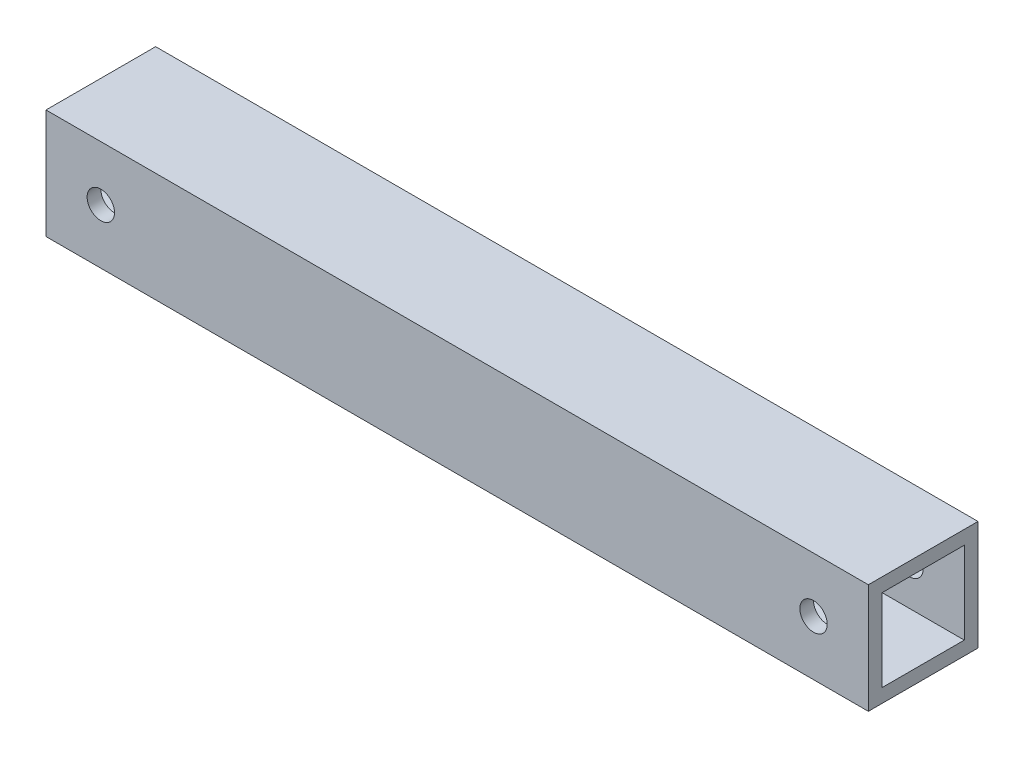
ISO-10303-21;
HEADER;
FILE_DESCRIPTION(('STEP AP214'),'2;1');
FILE_NAME('part.step','',(''),(''),'','','');
FILE_SCHEMA(('AUTOMOTIVE_DESIGN { 1 0 10303 214 1 1 1 1 }'));
ENDSEC;
DATA;
#1=APPLICATION_CONTEXT('core data for automotive mechanical design processes');
#2=APPLICATION_PROTOCOL_DEFINITION('international standard','automotive_design',2000,#1);
#3=PRODUCT_CONTEXT('',#1,'mechanical');
#4=PRODUCT('Part','Part','',(#3));
#5=PRODUCT_RELATED_PRODUCT_CATEGORY('part','',(#4));
#6=PRODUCT_DEFINITION_FORMATION('','',#4);
#7=PRODUCT_DEFINITION_CONTEXT('part definition',#1,'design');
#8=PRODUCT_DEFINITION('design','',#6,#7);
#9=PRODUCT_DEFINITION_SHAPE('','',#8);
#10=(LENGTH_UNIT() NAMED_UNIT(*) SI_UNIT(.MILLI.,.METRE.));
#11=(NAMED_UNIT(*) PLANE_ANGLE_UNIT() SI_UNIT($,.RADIAN.));
#12=(NAMED_UNIT(*) SI_UNIT($,.STERADIAN.) SOLID_ANGLE_UNIT());
#13=UNCERTAINTY_MEASURE_WITH_UNIT(LENGTH_MEASURE(1.E-05),#10,'distance_accuracy_value','');
#14=(GEOMETRIC_REPRESENTATION_CONTEXT(3) GLOBAL_UNCERTAINTY_ASSIGNED_CONTEXT((#13)) GLOBAL_UNIT_ASSIGNED_CONTEXT((#10,
#11,#12)) REPRESENTATION_CONTEXT('',''));
#15=CARTESIAN_POINT('',(0.,0.,0.));
#16=DIRECTION('',(0.,0.,1.));
#17=DIRECTION('',(1.,0.,0.));
#18=AXIS2_PLACEMENT_3D('',#15,#16,#17);
#19=CARTESIAN_POINT('',(95.25,-12.7,25.4));
#20=DIRECTION('',(-1.,0.,0.));
#21=DIRECTION('',(0.,0.,1.));
#22=AXIS2_PLACEMENT_3D('',#19,#20,#21);
#23=PLANE('',#22);
#24=DIRECTION('',(0.,1.,0.));
#25=VECTOR('',#24,1.);
#26=CARTESIAN_POINT('',(95.25,-12.7,0.));
#27=LINE('',#26,#25);
#28=CARTESIAN_POINT('',(95.25,-12.7,0.));
#29=VERTEX_POINT('',#28);
#30=CARTESIAN_POINT('',(95.25,12.7,0.));
#31=VERTEX_POINT('',#30);
#32=EDGE_CURVE('E122',#29,#31,#27,.T.);
#33=ORIENTED_EDGE('',*,*,#32,.T.);
#34=DIRECTION('',(0.,0.,-1.));
#35=VECTOR('',#34,1.);
#36=CARTESIAN_POINT('',(95.25,12.7,25.4));
#37=LINE('',#36,#35);
#38=CARTESIAN_POINT('',(95.25,12.7,25.4));
#39=VERTEX_POINT('',#38);
#40=EDGE_CURVE('E151',#39,#31,#37,.T.);
#41=ORIENTED_EDGE('',*,*,#40,.F.);
#42=DIRECTION('',(0.,1.,0.));
#43=VECTOR('',#42,1.);
#44=CARTESIAN_POINT('',(95.25,-12.7,25.4));
#45=LINE('',#44,#43);
#46=CARTESIAN_POINT('',(95.25,-12.7,25.4));
#47=VERTEX_POINT('',#46);
#48=EDGE_CURVE('E125',#47,#39,#45,.T.);
#49=ORIENTED_EDGE('',*,*,#48,.F.);
#50=DIRECTION('',(0.,0.,-1.));
#51=VECTOR('',#50,1.);
#52=CARTESIAN_POINT('',(95.25,-12.7,25.4));
#53=LINE('',#52,#51);
#54=EDGE_CURVE('E135',#47,#29,#53,.T.);
#55=ORIENTED_EDGE('',*,*,#54,.T.);
#56=EDGE_LOOP('',(#33,#41,#49,#55));
#57=FACE_BOUND('',#56,.T.);
#58=DIRECTION('',(0.,0.,-1.));
#59=VECTOR('',#58,1.);
#60=CARTESIAN_POINT('',(95.25,9.52035864154581,0.));
#61=LINE('',#60,#59);
#62=CARTESIAN_POINT('',(95.25,9.52035864154581,22.225));
#63=VERTEX_POINT('',#62);
#64=CARTESIAN_POINT('',(95.25,9.52035864154581,3.175));
#65=VERTEX_POINT('',#64);
#66=EDGE_CURVE('E49',#63,#65,#61,.T.);
#67=ORIENTED_EDGE('',*,*,#66,.T.);
#68=DIRECTION('',(0.,1.,0.));
#69=VECTOR('',#68,1.);
#70=CARTESIAN_POINT('',(95.25,0.,3.175));
#71=LINE('',#70,#69);
#72=CARTESIAN_POINT('',(95.25,-9.52035864154582,3.175));
#73=VERTEX_POINT('',#72);
#74=EDGE_CURVE('E115',#73,#65,#71,.T.);
#75=ORIENTED_EDGE('',*,*,#74,.F.);
#76=DIRECTION('',(0.,0.,-1.));
#77=VECTOR('',#76,1.);
#78=CARTESIAN_POINT('',(95.25,-9.52035864154582,0.));
#79=LINE('',#78,#77);
#80=CARTESIAN_POINT('',(95.25,-9.52035864154582,22.225));
#81=VERTEX_POINT('',#80);
#82=EDGE_CURVE('E101',#81,#73,#79,.T.);
#83=ORIENTED_EDGE('',*,*,#82,.F.);
#84=DIRECTION('',(0.,1.,0.));
#85=VECTOR('',#84,1.);
#86=CARTESIAN_POINT('',(95.25,0.,22.225));
#87=LINE('',#86,#85);
#88=EDGE_CURVE('E110',#81,#63,#87,.T.);
#89=ORIENTED_EDGE('',*,*,#88,.T.);
#90=EDGE_LOOP('',(#67,#75,#83,#89));
#91=FACE_BOUND('',#90,.T.);
#92=ADVANCED_FACE('F33',(#57,#91),#23,.F.);
#93=CARTESIAN_POINT('',(-95.25,-12.7,25.4));
#94=DIRECTION('',(1.,0.,0.));
#95=DIRECTION('',(0.,0.,-1.));
#96=AXIS2_PLACEMENT_3D('',#93,#94,#95);
#97=PLANE('',#96);
#98=DIRECTION('',(0.,-1.,0.));
#99=VECTOR('',#98,1.);
#100=CARTESIAN_POINT('',(-95.25,-12.7,0.));
#101=LINE('',#100,#99);
#102=CARTESIAN_POINT('',(-95.25,12.7,0.));
#103=VERTEX_POINT('',#102);
#104=CARTESIAN_POINT('',(-95.25,-12.7,0.));
#105=VERTEX_POINT('',#104);
#106=EDGE_CURVE('E140',#103,#105,#101,.T.);
#107=ORIENTED_EDGE('',*,*,#106,.T.);
#108=DIRECTION('',(0.,0.,-1.));
#109=VECTOR('',#108,1.);
#110=CARTESIAN_POINT('',(-95.25,-12.7,25.4));
#111=LINE('',#110,#109);
#112=CARTESIAN_POINT('',(-95.25,-12.7,25.4));
#113=VERTEX_POINT('',#112);
#114=EDGE_CURVE('E145',#113,#105,#111,.T.);
#115=ORIENTED_EDGE('',*,*,#114,.F.);
#116=DIRECTION('',(0.,-1.,0.));
#117=VECTOR('',#116,1.);
#118=CARTESIAN_POINT('',(-95.25,-12.7,25.4));
#119=LINE('',#118,#117);
#120=CARTESIAN_POINT('',(-95.25,12.7,25.4));
#121=VERTEX_POINT('',#120);
#122=EDGE_CURVE('E131',#121,#113,#119,.T.);
#123=ORIENTED_EDGE('',*,*,#122,.F.);
#124=DIRECTION('',(0.,0.,-1.));
#125=VECTOR('',#124,1.);
#126=CARTESIAN_POINT('',(-95.25,12.7,25.4));
#127=LINE('',#126,#125);
#128=EDGE_CURVE('E148',#121,#103,#127,.T.);
#129=ORIENTED_EDGE('',*,*,#128,.T.);
#130=EDGE_LOOP('',(#107,#115,#123,#129));
#131=FACE_BOUND('',#130,.T.);
#132=DIRECTION('',(0.,0.,-1.));
#133=VECTOR('',#132,1.);
#134=CARTESIAN_POINT('',(-95.25,9.52035864154581,25.4));
#135=LINE('',#134,#133);
#136=CARTESIAN_POINT('',(-95.2499999999999,9.52035864154581,22.225));
#137=VERTEX_POINT('',#136);
#138=CARTESIAN_POINT('',(-95.2499999999999,9.52035864154581,3.175));
#139=VERTEX_POINT('',#138);
#140=EDGE_CURVE('E11',#137,#139,#135,.T.);
#141=ORIENTED_EDGE('',*,*,#140,.F.);
#142=DIRECTION('',(0.,1.,0.));
#143=VECTOR('',#142,1.);
#144=CARTESIAN_POINT('',(-95.25,-12.7,22.225));
#145=LINE('',#144,#143);
#146=CARTESIAN_POINT('',(-95.25,-9.52035864154582,22.225));
#147=VERTEX_POINT('',#146);
#148=EDGE_CURVE('E154',#147,#137,#145,.T.);
#149=ORIENTED_EDGE('',*,*,#148,.F.);
#150=DIRECTION('',(0.,0.,-1.));
#151=VECTOR('',#150,1.);
#152=CARTESIAN_POINT('',(-95.25,-9.52035864154582,25.4));
#153=LINE('',#152,#151);
#154=CARTESIAN_POINT('',(-95.2499999999999,-9.52035864154582,3.175));
#155=VERTEX_POINT('',#154);
#156=EDGE_CURVE('E104',#147,#155,#153,.T.);
#157=ORIENTED_EDGE('',*,*,#156,.T.);
#158=DIRECTION('',(0.,1.,0.));
#159=VECTOR('',#158,1.);
#160=CARTESIAN_POINT('',(-95.25,-12.7,3.175));
#161=LINE('',#160,#159);
#162=EDGE_CURVE('E41',#155,#139,#161,.T.);
#163=ORIENTED_EDGE('',*,*,#162,.T.);
#164=EDGE_LOOP('',(#141,#149,#157,#163));
#165=FACE_BOUND('',#164,.T.);
#166=ADVANCED_FACE('F208',(#131,#165),#97,.F.);
#167=CARTESIAN_POINT('',(-95.25,12.7,25.4));
#168=DIRECTION('',(0.,-1.,0.));
#169=DIRECTION('',(0.,0.,-1.));
#170=AXIS2_PLACEMENT_3D('',#167,#168,#169);
#171=PLANE('',#170);
#172=DIRECTION('',(-1.,0.,0.));
#173=VECTOR('',#172,1.);
#174=CARTESIAN_POINT('',(-95.25,12.7,0.));
#175=LINE('',#174,#173);
#176=EDGE_CURVE('E138',#31,#103,#175,.T.);
#177=ORIENTED_EDGE('',*,*,#176,.T.);
#178=ORIENTED_EDGE('',*,*,#128,.F.);
#179=DIRECTION('',(-1.,0.,0.));
#180=VECTOR('',#179,1.);
#181=CARTESIAN_POINT('',(-95.25,12.7,25.4));
#182=LINE('',#181,#180);
#183=EDGE_CURVE('E128',#39,#121,#182,.T.);
#184=ORIENTED_EDGE('',*,*,#183,.F.);
#185=ORIENTED_EDGE('',*,*,#40,.T.);
#186=EDGE_LOOP('',(#177,#178,#184,#185));
#187=FACE_BOUND('',#186,.T.);
#188=ADVANCED_FACE('F212',(#187),#171,.F.);
#189=CARTESIAN_POINT('',(-95.25,-12.7,25.4));
#190=DIRECTION('',(0.,1.,0.));
#191=DIRECTION('',(0.,0.,1.));
#192=AXIS2_PLACEMENT_3D('',#189,#190,#191);
#193=PLANE('',#192);
#194=DIRECTION('',(1.,0.,0.));
#195=VECTOR('',#194,1.);
#196=CARTESIAN_POINT('',(-95.25,-12.7,0.));
#197=LINE('',#196,#195);
#198=EDGE_CURVE('E129',#105,#29,#197,.T.);
#199=ORIENTED_EDGE('',*,*,#198,.T.);
#200=ORIENTED_EDGE('',*,*,#54,.F.);
#201=DIRECTION('',(1.,0.,0.));
#202=VECTOR('',#201,1.);
#203=CARTESIAN_POINT('',(-95.25,-12.7,25.4));
#204=LINE('',#203,#202);
#205=EDGE_CURVE('E133',#113,#47,#204,.T.);
#206=ORIENTED_EDGE('',*,*,#205,.F.);
#207=ORIENTED_EDGE('',*,*,#114,.T.);
#208=EDGE_LOOP('',(#199,#200,#206,#207));
#209=FACE_BOUND('',#208,.T.);
#210=ADVANCED_FACE('F204',(#209),#193,.F.);
#211=CARTESIAN_POINT('',(0.,0.,25.4));
#212=DIRECTION('',(0.,0.,-1.));
#213=DIRECTION('',(-1.,0.,0.));
#214=AXIS2_PLACEMENT_3D('',#211,#212,#213);
#215=PLANE('',#214);
#216=CARTESIAN_POINT('',(-82.55,0.,25.4));
#217=DIRECTION('',(0.,0.,1.));
#218=DIRECTION('',(1.,0.,0.));
#219=AXIS2_PLACEMENT_3D('',#216,#217,#218);
#220=CIRCLE('',#219,3.175);
#221=CARTESIAN_POINT('',(-79.375,0.,25.4));
#222=VERTEX_POINT('',#221);
#223=EDGE_CURVE('E161',#222,#222,#220,.T.);
#224=ORIENTED_EDGE('',*,*,#223,.F.);
#225=EDGE_LOOP('',(#224));
#226=FACE_BOUND('',#225,.T.);
#227=CARTESIAN_POINT('',(82.55,0.,25.4));
#228=DIRECTION('',(0.,0.,1.));
#229=DIRECTION('',(1.,0.,0.));
#230=AXIS2_PLACEMENT_3D('',#227,#228,#229);
#231=CIRCLE('',#230,3.175);
#232=CARTESIAN_POINT('',(85.725,0.,25.4));
#233=VERTEX_POINT('',#232);
#234=EDGE_CURVE('E168',#233,#233,#231,.T.);
#235=ORIENTED_EDGE('',*,*,#234,.F.);
#236=EDGE_LOOP('',(#235));
#237=FACE_BOUND('',#236,.T.);
#238=ORIENTED_EDGE('',*,*,#48,.T.);
#239=ORIENTED_EDGE('',*,*,#183,.T.);
#240=ORIENTED_EDGE('',*,*,#122,.T.);
#241=ORIENTED_EDGE('',*,*,#205,.T.);
#242=EDGE_LOOP('',(#238,#239,#240,#241));
#243=FACE_BOUND('',#242,.T.);
#244=ADVANCED_FACE('F191',(#226,#237,#243),#215,.F.);
#245=CARTESIAN_POINT('',(0.,0.,0.));
#246=DIRECTION('',(0.,0.,-1.));
#247=DIRECTION('',(-1.,0.,0.));
#248=AXIS2_PLACEMENT_3D('',#245,#246,#247);
#249=PLANE('',#248);
#250=CARTESIAN_POINT('',(-82.55,0.,0.));
#251=DIRECTION('',(0.,0.,-1.));
#252=DIRECTION('',(-1.,0.,0.));
#253=AXIS2_PLACEMENT_3D('',#250,#251,#252);
#254=CIRCLE('',#253,3.175);
#255=CARTESIAN_POINT('',(-85.725,0.,0.));
#256=VERTEX_POINT('',#255);
#257=EDGE_CURVE('E180',#256,#256,#254,.T.);
#258=ORIENTED_EDGE('',*,*,#257,.F.);
#259=EDGE_LOOP('',(#258));
#260=FACE_BOUND('',#259,.T.);
#261=CARTESIAN_POINT('',(82.55,0.,0.));
#262=DIRECTION('',(0.,0.,-1.));
#263=DIRECTION('',(-1.,0.,0.));
#264=AXIS2_PLACEMENT_3D('',#261,#262,#263);
#265=CIRCLE('',#264,3.175);
#266=CARTESIAN_POINT('',(79.375,0.,0.));
#267=VERTEX_POINT('',#266);
#268=EDGE_CURVE('E165',#267,#267,#265,.T.);
#269=ORIENTED_EDGE('',*,*,#268,.F.);
#270=EDGE_LOOP('',(#269));
#271=FACE_BOUND('',#270,.T.);
#272=ORIENTED_EDGE('',*,*,#32,.F.);
#273=ORIENTED_EDGE('',*,*,#198,.F.);
#274=ORIENTED_EDGE('',*,*,#106,.F.);
#275=ORIENTED_EDGE('',*,*,#176,.F.);
#276=EDGE_LOOP('',(#272,#273,#274,#275));
#277=FACE_BOUND('',#276,.T.);
#278=ADVANCED_FACE('F187',(#260,#271,#277),#249,.T.);
#279=CARTESIAN_POINT('',(-412.75,9.52035864154581,0.));
#280=DIRECTION('',(0.,-1.,0.));
#281=DIRECTION('',(0.,0.,-1.));
#282=AXIS2_PLACEMENT_3D('',#279,#280,#281);
#283=PLANE('',#282);
#284=ORIENTED_EDGE('',*,*,#140,.T.);
#285=DIRECTION('',(1.,0.,0.));
#286=VECTOR('',#285,1.);
#287=CARTESIAN_POINT('',(-412.75,9.52035864154581,3.175));
#288=LINE('',#287,#286);
#289=EDGE_CURVE('E120',#139,#65,#288,.T.);
#290=ORIENTED_EDGE('',*,*,#289,.T.);
#291=ORIENTED_EDGE('',*,*,#66,.F.);
#292=DIRECTION('',(1.,0.,0.));
#293=VECTOR('',#292,1.);
#294=CARTESIAN_POINT('',(-412.75,9.52035864154581,22.225));
#295=LINE('',#294,#293);
#296=EDGE_CURVE('E107',#137,#63,#295,.T.);
#297=ORIENTED_EDGE('',*,*,#296,.F.);
#298=EDGE_LOOP('',(#284,#290,#291,#297));
#299=FACE_BOUND('',#298,.T.);
#300=ADVANCED_FACE('F190',(#299),#283,.T.);
#301=CARTESIAN_POINT('',(-412.75,0.,3.175));
#302=DIRECTION('',(0.,0.,-1.));
#303=DIRECTION('',(-1.,0.,0.));
#304=AXIS2_PLACEMENT_3D('',#301,#302,#303);
#305=PLANE('',#304);
#306=CARTESIAN_POINT('',(-82.55,0.,3.17499999999998));
#307=DIRECTION('',(0.,0.,-1.));
#308=DIRECTION('',(-1.,0.,0.));
#309=AXIS2_PLACEMENT_3D('',#306,#307,#308);
#310=CIRCLE('',#309,3.175);
#311=CARTESIAN_POINT('',(-85.725,0.,3.17499999999998));
#312=VERTEX_POINT('',#311);
#313=EDGE_CURVE('E177',#312,#312,#310,.T.);
#314=ORIENTED_EDGE('',*,*,#313,.T.);
#315=EDGE_LOOP('',(#314));
#316=FACE_BOUND('',#315,.T.);
#317=CARTESIAN_POINT('',(82.55,0.,3.17499999999998));
#318=DIRECTION('',(0.,0.,-1.));
#319=DIRECTION('',(-1.,0.,0.));
#320=AXIS2_PLACEMENT_3D('',#317,#318,#319);
#321=CIRCLE('',#320,3.175);
#322=CARTESIAN_POINT('',(79.375,0.,3.17499999999998));
#323=VERTEX_POINT('',#322);
#324=EDGE_CURVE('E160',#323,#323,#321,.T.);
#325=ORIENTED_EDGE('',*,*,#324,.T.);
#326=EDGE_LOOP('',(#325));
#327=FACE_BOUND('',#326,.T.);
#328=DIRECTION('',(1.,0.,0.));
#329=VECTOR('',#328,1.);
#330=CARTESIAN_POINT('',(-412.75,-9.52035864154582,3.175));
#331=LINE('',#330,#329);
#332=EDGE_CURVE('E106',#155,#73,#331,.T.);
#333=ORIENTED_EDGE('',*,*,#332,.T.);
#334=ORIENTED_EDGE('',*,*,#74,.T.);
#335=ORIENTED_EDGE('',*,*,#289,.F.);
#336=ORIENTED_EDGE('',*,*,#162,.F.);
#337=EDGE_LOOP('',(#333,#334,#335,#336));
#338=FACE_BOUND('',#337,.T.);
#339=ADVANCED_FACE('F256',(#316,#327,#338),#305,.F.);
#340=CARTESIAN_POINT('',(-412.75,-9.52035864154582,0.));
#341=DIRECTION('',(0.,-1.,0.));
#342=DIRECTION('',(0.,0.,-1.));
#343=AXIS2_PLACEMENT_3D('',#340,#341,#342);
#344=PLANE('',#343);
#345=DIRECTION('',(1.,0.,0.));
#346=VECTOR('',#345,1.);
#347=CARTESIAN_POINT('',(-412.75,-9.52035864154582,22.225));
#348=LINE('',#347,#346);
#349=EDGE_CURVE('E57',#147,#81,#348,.T.);
#350=ORIENTED_EDGE('',*,*,#349,.T.);
#351=ORIENTED_EDGE('',*,*,#82,.T.);
#352=ORIENTED_EDGE('',*,*,#332,.F.);
#353=ORIENTED_EDGE('',*,*,#156,.F.);
#354=EDGE_LOOP('',(#350,#351,#352,#353));
#355=FACE_BOUND('',#354,.T.);
#356=ADVANCED_FACE('F98',(#355),#344,.F.);
#357=CARTESIAN_POINT('',(-412.75,0.,22.225));
#358=DIRECTION('',(0.,0.,-1.));
#359=DIRECTION('',(0.,1.,0.));
#360=AXIS2_PLACEMENT_3D('',#357,#358,#359);
#361=PLANE('',#360);
#362=CARTESIAN_POINT('',(-82.55,0.,22.2250000000001));
#363=DIRECTION('',(0.,0.,-1.));
#364=DIRECTION('',(0.,1.,0.));
#365=AXIS2_PLACEMENT_3D('',#362,#363,#364);
#366=CIRCLE('',#365,3.175);
#367=CARTESIAN_POINT('',(-82.55,3.17499999999998,22.2250000000001));
#368=VERTEX_POINT('',#367);
#369=EDGE_CURVE('E36',#368,#368,#366,.T.);
#370=ORIENTED_EDGE('',*,*,#369,.F.);
#371=EDGE_LOOP('',(#370));
#372=FACE_BOUND('',#371,.T.);
#373=CARTESIAN_POINT('',(82.55,0.,22.2250000000001));
#374=DIRECTION('',(0.,0.,-1.));
#375=DIRECTION('',(0.,1.,0.));
#376=AXIS2_PLACEMENT_3D('',#373,#374,#375);
#377=CIRCLE('',#376,3.175);
#378=CARTESIAN_POINT('',(82.55,3.175,22.2250000000001));
#379=VERTEX_POINT('',#378);
#380=EDGE_CURVE('E158',#379,#379,#377,.T.);
#381=ORIENTED_EDGE('',*,*,#380,.F.);
#382=EDGE_LOOP('',(#381));
#383=FACE_BOUND('',#382,.T.);
#384=ORIENTED_EDGE('',*,*,#148,.T.);
#385=ORIENTED_EDGE('',*,*,#296,.T.);
#386=ORIENTED_EDGE('',*,*,#88,.F.);
#387=ORIENTED_EDGE('',*,*,#349,.F.);
#388=EDGE_LOOP('',(#384,#385,#386,#387));
#389=FACE_BOUND('',#388,.T.);
#390=ADVANCED_FACE('F111',(#372,#383,#389),#361,.T.);
#391=CARTESIAN_POINT('',(82.55,0.,-482.6));
#392=DIRECTION('',(0.,0.,1.));
#393=DIRECTION('',(1.,0.,0.));
#394=AXIS2_PLACEMENT_3D('',#391,#392,#393);
#395=CYLINDRICAL_SURFACE('',#394,3.175);
#396=ORIENTED_EDGE('',*,*,#380,.T.);
#397=EDGE_LOOP('',(#396));
#398=FACE_BOUND('',#397,.T.);
#399=ORIENTED_EDGE('',*,*,#234,.T.);
#400=EDGE_LOOP('',(#399));
#401=FACE_BOUND('',#400,.T.);
#402=ADVANCED_FACE('F289',(#398,#401),#395,.F.);
#403=CARTESIAN_POINT('',(-82.55,0.,-482.6));
#404=DIRECTION('',(0.,0.,1.));
#405=DIRECTION('',(1.,0.,0.));
#406=AXIS2_PLACEMENT_3D('',#403,#404,#405);
#407=CYLINDRICAL_SURFACE('',#406,3.175);
#408=ORIENTED_EDGE('',*,*,#369,.T.);
#409=EDGE_LOOP('',(#408));
#410=FACE_BOUND('',#409,.T.);
#411=ORIENTED_EDGE('',*,*,#223,.T.);
#412=EDGE_LOOP('',(#411));
#413=FACE_BOUND('',#412,.T.);
#414=ADVANCED_FACE('F299',(#410,#413),#407,.F.);
#415=ORIENTED_EDGE('',*,*,#268,.T.);
#416=EDGE_LOOP('',(#415));
#417=FACE_BOUND('',#416,.T.);
#418=ORIENTED_EDGE('',*,*,#324,.F.);
#419=EDGE_LOOP('',(#418));
#420=FACE_BOUND('',#419,.T.);
#421=ADVANCED_FACE('F301',(#417,#420),#395,.F.);
#422=ORIENTED_EDGE('',*,*,#257,.T.);
#423=EDGE_LOOP('',(#422));
#424=FACE_BOUND('',#423,.T.);
#425=ORIENTED_EDGE('',*,*,#313,.F.);
#426=EDGE_LOOP('',(#425));
#427=FACE_BOUND('',#426,.T.);
#428=ADVANCED_FACE('F184',(#424,#427),#407,.F.);
#429=CLOSED_SHELL('',(#92,#166,#188,#210,#244,#278,#300,#339,#356,#390,#402,#414,#421,#428));
#430=MANIFOLD_SOLID_BREP('B2',#429);
#431=ADVANCED_BREP_SHAPE_REPRESENTATION('',(#18,#430),#14);
#432=SHAPE_DEFINITION_REPRESENTATION(#9,#431);
ENDSEC;
END-ISO-10303-21;
